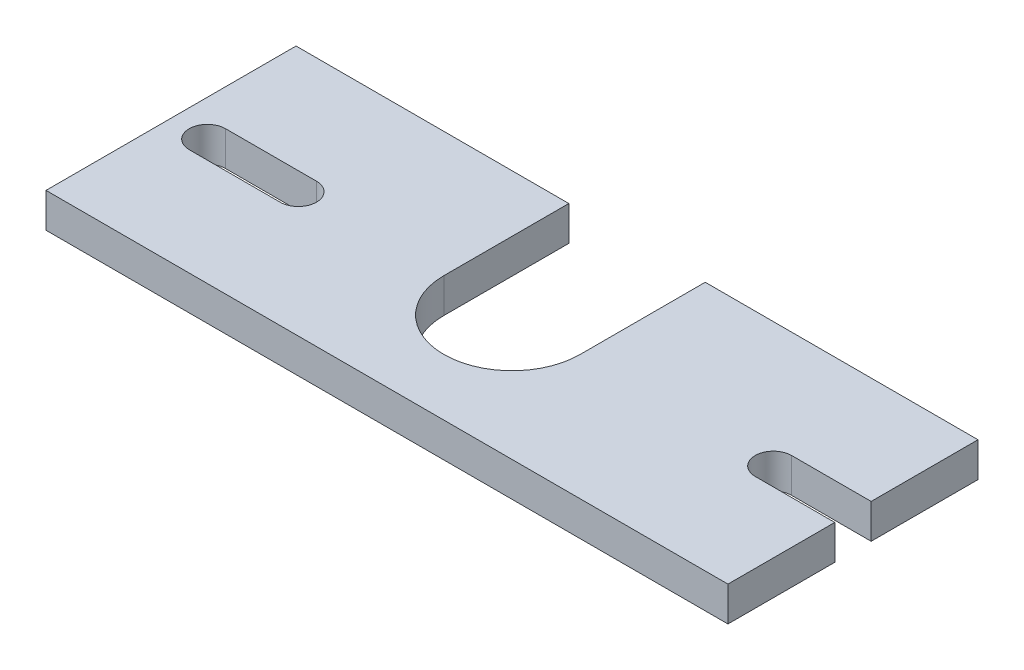
ISO-10303-21;
HEADER;
FILE_DESCRIPTION(('STEP AP214'),'2;1');
FILE_NAME('part.step','',(''),(''),'','','');
FILE_SCHEMA(('AUTOMOTIVE_DESIGN { 1 0 10303 214 1 1 1 1 }'));
ENDSEC;
DATA;
#1=APPLICATION_CONTEXT('core data for automotive mechanical design processes');
#2=APPLICATION_PROTOCOL_DEFINITION('international standard','automotive_design',2000,#1);
#3=PRODUCT_CONTEXT('',#1,'mechanical');
#4=PRODUCT('Part','Part','',(#3));
#5=PRODUCT_RELATED_PRODUCT_CATEGORY('part','',(#4));
#6=PRODUCT_DEFINITION_FORMATION('','',#4);
#7=PRODUCT_DEFINITION_CONTEXT('part definition',#1,'design');
#8=PRODUCT_DEFINITION('design','',#6,#7);
#9=PRODUCT_DEFINITION_SHAPE('','',#8);
#10=(LENGTH_UNIT() NAMED_UNIT(*) SI_UNIT(.MILLI.,.METRE.));
#11=(NAMED_UNIT(*) PLANE_ANGLE_UNIT() SI_UNIT($,.RADIAN.));
#12=(NAMED_UNIT(*) SI_UNIT($,.STERADIAN.) SOLID_ANGLE_UNIT());
#13=UNCERTAINTY_MEASURE_WITH_UNIT(LENGTH_MEASURE(1.E-05),#10,'distance_accuracy_value','');
#14=(GEOMETRIC_REPRESENTATION_CONTEXT(3) GLOBAL_UNCERTAINTY_ASSIGNED_CONTEXT((#13)) GLOBAL_UNIT_ASSIGNED_CONTEXT((#10,
#11,#12)) REPRESENTATION_CONTEXT('',''));
#15=CARTESIAN_POINT('',(0.,0.,0.));
#16=DIRECTION('',(0.,0.,1.));
#17=DIRECTION('',(1.,0.,0.));
#18=AXIS2_PLACEMENT_3D('',#15,#16,#17);
#19=CARTESIAN_POINT('',(30.,3.04,-11.));
#20=DIRECTION('',(0.,1.,0.));
#21=DIRECTION('',(0.,0.,1.));
#22=AXIS2_PLACEMENT_3D('',#19,#20,#21);
#23=PLANE('',#22);
#24=DIRECTION('',(0.,0.,1.));
#25=VECTOR('',#24,1.);
#26=CARTESIAN_POINT('',(0.,3.04,0.));
#27=LINE('',#26,#25);
#28=CARTESIAN_POINT('',(0.,3.04,-22.));
#29=VERTEX_POINT('',#28);
#30=CARTESIAN_POINT('',(0.,3.04,0.));
#31=VERTEX_POINT('',#30);
#32=EDGE_CURVE('E182',#29,#31,#27,.T.);
#33=ORIENTED_EDGE('',*,*,#32,.T.);
#34=DIRECTION('',(1.,0.,0.));
#35=VECTOR('',#34,1.);
#36=CARTESIAN_POINT('',(0.,3.04,0.));
#37=LINE('',#36,#35);
#38=CARTESIAN_POINT('',(60.,3.04,0.));
#39=VERTEX_POINT('',#38);
#40=EDGE_CURVE('E185',#31,#39,#37,.T.);
#41=ORIENTED_EDGE('',*,*,#40,.T.);
#42=DIRECTION('',(0.,0.,-1.));
#43=VECTOR('',#42,1.);
#44=CARTESIAN_POINT('',(60.,3.04,0.));
#45=LINE('',#44,#43);
#46=CARTESIAN_POINT('',(60.,3.04,-9.4));
#47=VERTEX_POINT('',#46);
#48=EDGE_CURVE('E188',#39,#47,#45,.T.);
#49=ORIENTED_EDGE('',*,*,#48,.T.);
#50=DIRECTION('',(-1.,0.,0.));
#51=VECTOR('',#50,1.);
#52=CARTESIAN_POINT('',(53.,3.04,-9.4));
#53=LINE('',#52,#51);
#54=CARTESIAN_POINT('',(53.,3.04,-9.4));
#55=VERTEX_POINT('',#54);
#56=EDGE_CURVE('E190',#47,#55,#53,.T.);
#57=ORIENTED_EDGE('',*,*,#56,.T.);
#58=CARTESIAN_POINT('',(53.,3.04,-11.));
#59=DIRECTION('',(0.,-1.,0.));
#60=DIRECTION('',(0.,0.,1.));
#61=AXIS2_PLACEMENT_3D('',#58,#59,#60);
#62=CIRCLE('',#61,1.6);
#63=CARTESIAN_POINT('',(53.,3.04,-12.6));
#64=VERTEX_POINT('',#63);
#65=EDGE_CURVE('E192',#55,#64,#62,.T.);
#66=ORIENTED_EDGE('',*,*,#65,.T.);
#67=DIRECTION('',(1.,0.,0.));
#68=VECTOR('',#67,1.);
#69=CARTESIAN_POINT('',(53.,3.04,-12.6));
#70=LINE('',#69,#68);
#71=CARTESIAN_POINT('',(60.,3.04,-12.6));
#72=VERTEX_POINT('',#71);
#73=EDGE_CURVE('E194',#64,#72,#70,.T.);
#74=ORIENTED_EDGE('',*,*,#73,.T.);
#75=DIRECTION('',(0.,0.,-1.));
#76=VECTOR('',#75,1.);
#77=CARTESIAN_POINT('',(60.,3.04,-12.6));
#78=LINE('',#77,#76);
#79=CARTESIAN_POINT('',(60.,3.04,-22.));
#80=VERTEX_POINT('',#79);
#81=EDGE_CURVE('E196',#72,#80,#78,.T.);
#82=ORIENTED_EDGE('',*,*,#81,.T.);
#83=DIRECTION('',(-1.,0.,0.));
#84=VECTOR('',#83,1.);
#85=CARTESIAN_POINT('',(36.,3.04,-22.));
#86=LINE('',#85,#84);
#87=CARTESIAN_POINT('',(36.,3.04,-22.));
#88=VERTEX_POINT('',#87);
#89=EDGE_CURVE('E198',#80,#88,#86,.T.);
#90=ORIENTED_EDGE('',*,*,#89,.T.);
#91=DIRECTION('',(0.,0.,1.));
#92=VECTOR('',#91,1.);
#93=CARTESIAN_POINT('',(36.,3.04,-11.));
#94=LINE('',#93,#92);
#95=CARTESIAN_POINT('',(36.,3.04,-11.));
#96=VERTEX_POINT('',#95);
#97=EDGE_CURVE('E200',#88,#96,#94,.T.);
#98=ORIENTED_EDGE('',*,*,#97,.T.);
#99=CARTESIAN_POINT('',(30.,3.04,-11.));
#100=DIRECTION('',(0.,-1.,0.));
#101=DIRECTION('',(0.,0.,1.));
#102=AXIS2_PLACEMENT_3D('',#99,#100,#101);
#103=CIRCLE('',#102,6.);
#104=CARTESIAN_POINT('',(24.,3.04,-11.));
#105=VERTEX_POINT('',#104);
#106=EDGE_CURVE('E202',#96,#105,#103,.T.);
#107=ORIENTED_EDGE('',*,*,#106,.T.);
#108=DIRECTION('',(0.,0.,-1.));
#109=VECTOR('',#108,1.);
#110=CARTESIAN_POINT('',(24.,3.04,-22.));
#111=LINE('',#110,#109);
#112=CARTESIAN_POINT('',(24.,3.04,-22.));
#113=VERTEX_POINT('',#112);
#114=EDGE_CURVE('E204',#105,#113,#111,.T.);
#115=ORIENTED_EDGE('',*,*,#114,.T.);
#116=DIRECTION('',(-1.,0.,0.));
#117=VECTOR('',#116,1.);
#118=CARTESIAN_POINT('',(0.,3.04,-22.));
#119=LINE('',#118,#117);
#120=EDGE_CURVE('E206',#113,#29,#119,.T.);
#121=ORIENTED_EDGE('',*,*,#120,.T.);
#122=EDGE_LOOP('',(#33,#41,#49,#57,#66,#74,#82,#90,#98,#107,#115,#121));
#123=FACE_BOUND('',#122,.T.);
#124=DIRECTION('',(1.,0.,0.));
#125=VECTOR('',#124,1.);
#126=CARTESIAN_POINT('',(3.2,3.04,-9.4));
#127=LINE('',#126,#125);
#128=CARTESIAN_POINT('',(3.2,3.04,-9.4));
#129=VERTEX_POINT('',#128);
#130=CARTESIAN_POINT('',(11.2,3.04,-9.4));
#131=VERTEX_POINT('',#130);
#132=EDGE_CURVE('E154',#129,#131,#127,.T.);
#133=ORIENTED_EDGE('',*,*,#132,.F.);
#134=CARTESIAN_POINT('',(3.2,3.04,-11.));
#135=DIRECTION('',(0.,1.,0.));
#136=DIRECTION('',(0.,0.,1.));
#137=AXIS2_PLACEMENT_3D('',#134,#135,#136);
#138=CIRCLE('',#137,1.6);
#139=CARTESIAN_POINT('',(3.2,3.04,-12.6));
#140=VERTEX_POINT('',#139);
#141=EDGE_CURVE('E146',#140,#129,#138,.T.);
#142=ORIENTED_EDGE('',*,*,#141,.F.);
#143=DIRECTION('',(-1.,0.,0.));
#144=VECTOR('',#143,1.);
#145=CARTESIAN_POINT('',(3.2,3.04,-12.6));
#146=LINE('',#145,#144);
#147=CARTESIAN_POINT('',(11.2,3.04,-12.6));
#148=VERTEX_POINT('',#147);
#149=EDGE_CURVE('E168',#148,#140,#146,.T.);
#150=ORIENTED_EDGE('',*,*,#149,.F.);
#151=CARTESIAN_POINT('',(11.2,3.04,-11.));
#152=DIRECTION('',(0.,1.,0.));
#153=DIRECTION('',(0.,0.,1.));
#154=AXIS2_PLACEMENT_3D('',#151,#152,#153);
#155=CIRCLE('',#154,1.6);
#156=EDGE_CURVE('E166',#131,#148,#155,.T.);
#157=ORIENTED_EDGE('',*,*,#156,.F.);
#158=EDGE_LOOP('',(#133,#142,#150,#157));
#159=FACE_BOUND('',#158,.T.);
#160=ADVANCED_FACE('F33',(#123,#159),#23,.T.);
#161=CARTESIAN_POINT('',(30.,0.,-11.));
#162=DIRECTION('',(0.,1.,0.));
#163=DIRECTION('',(0.,0.,1.));
#164=AXIS2_PLACEMENT_3D('',#161,#162,#163);
#165=PLANE('',#164);
#166=DIRECTION('',(0.,0.,1.));
#167=VECTOR('',#166,1.);
#168=CARTESIAN_POINT('',(0.,0.,0.));
#169=LINE('',#168,#167);
#170=CARTESIAN_POINT('',(0.,0.,-22.));
#171=VERTEX_POINT('',#170);
#172=CARTESIAN_POINT('',(0.,0.,0.));
#173=VERTEX_POINT('',#172);
#174=EDGE_CURVE('E162',#171,#173,#169,.T.);
#175=ORIENTED_EDGE('',*,*,#174,.F.);
#176=DIRECTION('',(-1.,0.,0.));
#177=VECTOR('',#176,1.);
#178=CARTESIAN_POINT('',(0.,0.,-22.));
#179=LINE('',#178,#177);
#180=CARTESIAN_POINT('',(24.,0.,-22.));
#181=VERTEX_POINT('',#180);
#182=EDGE_CURVE('E186',#181,#171,#179,.T.);
#183=ORIENTED_EDGE('',*,*,#182,.F.);
#184=DIRECTION('',(0.,0.,-1.));
#185=VECTOR('',#184,1.);
#186=CARTESIAN_POINT('',(24.,0.,-22.));
#187=LINE('',#186,#185);
#188=CARTESIAN_POINT('',(24.,0.,-11.));
#189=VERTEX_POINT('',#188);
#190=EDGE_CURVE('E229',#189,#181,#187,.T.);
#191=ORIENTED_EDGE('',*,*,#190,.F.);
#192=CARTESIAN_POINT('',(30.,0.,-11.));
#193=DIRECTION('',(0.,-1.,0.));
#194=DIRECTION('',(0.,0.,1.));
#195=AXIS2_PLACEMENT_3D('',#192,#193,#194);
#196=CIRCLE('',#195,6.);
#197=CARTESIAN_POINT('',(36.,0.,-11.));
#198=VERTEX_POINT('',#197);
#199=EDGE_CURVE('E227',#198,#189,#196,.T.);
#200=ORIENTED_EDGE('',*,*,#199,.F.);
#201=DIRECTION('',(0.,0.,1.));
#202=VECTOR('',#201,1.);
#203=CARTESIAN_POINT('',(36.,0.,-11.));
#204=LINE('',#203,#202);
#205=CARTESIAN_POINT('',(36.,0.,-22.));
#206=VERTEX_POINT('',#205);
#207=EDGE_CURVE('E225',#206,#198,#204,.T.);
#208=ORIENTED_EDGE('',*,*,#207,.F.);
#209=DIRECTION('',(-1.,0.,0.));
#210=VECTOR('',#209,1.);
#211=CARTESIAN_POINT('',(36.,0.,-22.));
#212=LINE('',#211,#210);
#213=CARTESIAN_POINT('',(60.,0.,-22.));
#214=VERTEX_POINT('',#213);
#215=EDGE_CURVE('E223',#214,#206,#212,.T.);
#216=ORIENTED_EDGE('',*,*,#215,.F.);
#217=DIRECTION('',(0.,0.,-1.));
#218=VECTOR('',#217,1.);
#219=CARTESIAN_POINT('',(60.,0.,-12.6));
#220=LINE('',#219,#218);
#221=CARTESIAN_POINT('',(60.,0.,-12.6));
#222=VERTEX_POINT('',#221);
#223=EDGE_CURVE('E221',#222,#214,#220,.T.);
#224=ORIENTED_EDGE('',*,*,#223,.F.);
#225=DIRECTION('',(1.,0.,0.));
#226=VECTOR('',#225,1.);
#227=CARTESIAN_POINT('',(53.,0.,-12.6));
#228=LINE('',#227,#226);
#229=CARTESIAN_POINT('',(53.,0.,-12.6));
#230=VERTEX_POINT('',#229);
#231=EDGE_CURVE('E219',#230,#222,#228,.T.);
#232=ORIENTED_EDGE('',*,*,#231,.F.);
#233=CARTESIAN_POINT('',(53.,0.,-11.));
#234=DIRECTION('',(0.,-1.,0.));
#235=DIRECTION('',(0.,0.,1.));
#236=AXIS2_PLACEMENT_3D('',#233,#234,#235);
#237=CIRCLE('',#236,1.6);
#238=CARTESIAN_POINT('',(53.,0.,-9.4));
#239=VERTEX_POINT('',#238);
#240=EDGE_CURVE('E217',#239,#230,#237,.T.);
#241=ORIENTED_EDGE('',*,*,#240,.F.);
#242=DIRECTION('',(-1.,0.,0.));
#243=VECTOR('',#242,1.);
#244=CARTESIAN_POINT('',(53.,0.,-9.4));
#245=LINE('',#244,#243);
#246=CARTESIAN_POINT('',(60.,0.,-9.4));
#247=VERTEX_POINT('',#246);
#248=EDGE_CURVE('E215',#247,#239,#245,.T.);
#249=ORIENTED_EDGE('',*,*,#248,.F.);
#250=DIRECTION('',(0.,0.,-1.));
#251=VECTOR('',#250,1.);
#252=CARTESIAN_POINT('',(60.,0.,0.));
#253=LINE('',#252,#251);
#254=CARTESIAN_POINT('',(60.,0.,0.));
#255=VERTEX_POINT('',#254);
#256=EDGE_CURVE('E213',#255,#247,#253,.T.);
#257=ORIENTED_EDGE('',*,*,#256,.F.);
#258=DIRECTION('',(1.,0.,0.));
#259=VECTOR('',#258,1.);
#260=CARTESIAN_POINT('',(0.,0.,0.));
#261=LINE('',#260,#259);
#262=EDGE_CURVE('E211',#173,#255,#261,.T.);
#263=ORIENTED_EDGE('',*,*,#262,.F.);
#264=EDGE_LOOP('',(#175,#183,#191,#200,#208,#216,#224,#232,#241,#249,#257,#263));
#265=FACE_BOUND('',#264,.T.);
#266=CARTESIAN_POINT('',(3.2,0.,-11.));
#267=DIRECTION('',(0.,1.,0.));
#268=DIRECTION('',(0.,0.,1.));
#269=AXIS2_PLACEMENT_3D('',#266,#267,#268);
#270=CIRCLE('',#269,1.6);
#271=CARTESIAN_POINT('',(3.2,0.,-12.6));
#272=VERTEX_POINT('',#271);
#273=CARTESIAN_POINT('',(3.2,0.,-9.4));
#274=VERTEX_POINT('',#273);
#275=EDGE_CURVE('E56',#272,#274,#270,.T.);
#276=ORIENTED_EDGE('',*,*,#275,.T.);
#277=DIRECTION('',(1.,0.,0.));
#278=VECTOR('',#277,1.);
#279=CARTESIAN_POINT('',(3.2,0.,-9.4));
#280=LINE('',#279,#278);
#281=CARTESIAN_POINT('',(11.2,0.,-9.4));
#282=VERTEX_POINT('',#281);
#283=EDGE_CURVE('E161',#274,#282,#280,.T.);
#284=ORIENTED_EDGE('',*,*,#283,.T.);
#285=CARTESIAN_POINT('',(11.2,0.,-11.));
#286=DIRECTION('',(0.,1.,0.));
#287=DIRECTION('',(0.,0.,1.));
#288=AXIS2_PLACEMENT_3D('',#285,#286,#287);
#289=CIRCLE('',#288,1.6);
#290=CARTESIAN_POINT('',(11.2,0.,-12.6));
#291=VERTEX_POINT('',#290);
#292=EDGE_CURVE('E174',#282,#291,#289,.T.);
#293=ORIENTED_EDGE('',*,*,#292,.T.);
#294=DIRECTION('',(-1.,0.,0.));
#295=VECTOR('',#294,1.);
#296=CARTESIAN_POINT('',(3.2,0.,-12.6));
#297=LINE('',#296,#295);
#298=EDGE_CURVE('E155',#291,#272,#297,.T.);
#299=ORIENTED_EDGE('',*,*,#298,.T.);
#300=EDGE_LOOP('',(#276,#284,#293,#299));
#301=FACE_BOUND('',#300,.T.);
#302=ADVANCED_FACE('F271',(#265,#301),#165,.F.);
#303=CARTESIAN_POINT('',(0.,3.04,0.));
#304=DIRECTION('',(1.,0.,0.));
#305=DIRECTION('',(0.,0.,-1.));
#306=AXIS2_PLACEMENT_3D('',#303,#304,#305);
#307=PLANE('',#306);
#308=ORIENTED_EDGE('',*,*,#174,.T.);
#309=DIRECTION('',(0.,-1.,0.));
#310=VECTOR('',#309,1.);
#311=CARTESIAN_POINT('',(0.,3.04,0.));
#312=LINE('',#311,#310);
#313=EDGE_CURVE('E11',#31,#173,#312,.T.);
#314=ORIENTED_EDGE('',*,*,#313,.F.);
#315=ORIENTED_EDGE('',*,*,#32,.F.);
#316=DIRECTION('',(0.,-1.,0.));
#317=VECTOR('',#316,1.);
#318=CARTESIAN_POINT('',(0.,3.04,-22.));
#319=LINE('',#318,#317);
#320=EDGE_CURVE('E208',#29,#171,#319,.T.);
#321=ORIENTED_EDGE('',*,*,#320,.T.);
#322=EDGE_LOOP('',(#308,#314,#315,#321));
#323=FACE_BOUND('',#322,.T.);
#324=ADVANCED_FACE('F35',(#323),#307,.F.);
#325=CARTESIAN_POINT('',(0.,3.04,0.));
#326=DIRECTION('',(0.,0.,-1.));
#327=DIRECTION('',(-1.,0.,0.));
#328=AXIS2_PLACEMENT_3D('',#325,#326,#327);
#329=PLANE('',#328);
#330=ORIENTED_EDGE('',*,*,#262,.T.);
#331=DIRECTION('',(0.,-1.,0.));
#332=VECTOR('',#331,1.);
#333=CARTESIAN_POINT('',(60.,3.04,0.));
#334=LINE('',#333,#332);
#335=EDGE_CURVE('E41',#39,#255,#334,.T.);
#336=ORIENTED_EDGE('',*,*,#335,.F.);
#337=ORIENTED_EDGE('',*,*,#40,.F.);
#338=ORIENTED_EDGE('',*,*,#313,.T.);
#339=EDGE_LOOP('',(#330,#336,#337,#338));
#340=FACE_BOUND('',#339,.T.);
#341=ADVANCED_FACE('F288',(#340),#329,.F.);
#342=CARTESIAN_POINT('',(60.,3.04,0.));
#343=DIRECTION('',(-1.,0.,0.));
#344=DIRECTION('',(0.,0.,1.));
#345=AXIS2_PLACEMENT_3D('',#342,#343,#344);
#346=PLANE('',#345);
#347=ORIENTED_EDGE('',*,*,#256,.T.);
#348=DIRECTION('',(0.,-1.,0.));
#349=VECTOR('',#348,1.);
#350=CARTESIAN_POINT('',(60.,3.04,-9.4));
#351=LINE('',#350,#349);
#352=EDGE_CURVE('E258',#47,#247,#351,.T.);
#353=ORIENTED_EDGE('',*,*,#352,.F.);
#354=ORIENTED_EDGE('',*,*,#48,.F.);
#355=ORIENTED_EDGE('',*,*,#335,.T.);
#356=EDGE_LOOP('',(#347,#353,#354,#355));
#357=FACE_BOUND('',#356,.T.);
#358=ADVANCED_FACE('F265',(#357),#346,.F.);
#359=CARTESIAN_POINT('',(53.,3.04,-9.4));
#360=DIRECTION('',(0.,0.,1.));
#361=DIRECTION('',(1.,0.,0.));
#362=AXIS2_PLACEMENT_3D('',#359,#360,#361);
#363=PLANE('',#362);
#364=ORIENTED_EDGE('',*,*,#248,.T.);
#365=DIRECTION('',(0.,-1.,0.));
#366=VECTOR('',#365,1.);
#367=CARTESIAN_POINT('',(53.,3.04,-9.4));
#368=LINE('',#367,#366);
#369=EDGE_CURVE('E255',#55,#239,#368,.T.);
#370=ORIENTED_EDGE('',*,*,#369,.F.);
#371=ORIENTED_EDGE('',*,*,#56,.F.);
#372=ORIENTED_EDGE('',*,*,#352,.T.);
#373=EDGE_LOOP('',(#364,#370,#371,#372));
#374=FACE_BOUND('',#373,.T.);
#375=ADVANCED_FACE('F277',(#374),#363,.F.);
#376=CARTESIAN_POINT('',(53.,3.04,-11.));
#377=DIRECTION('',(0.,-1.,0.));
#378=DIRECTION('',(0.,0.,-1.));
#379=AXIS2_PLACEMENT_3D('',#376,#377,#378);
#380=CYLINDRICAL_SURFACE('',#379,1.6);
#381=ORIENTED_EDGE('',*,*,#240,.T.);
#382=DIRECTION('',(0.,-1.,0.));
#383=VECTOR('',#382,1.);
#384=CARTESIAN_POINT('',(53.,3.04,-12.6));
#385=LINE('',#384,#383);
#386=EDGE_CURVE('E252',#64,#230,#385,.T.);
#387=ORIENTED_EDGE('',*,*,#386,.F.);
#388=ORIENTED_EDGE('',*,*,#65,.F.);
#389=ORIENTED_EDGE('',*,*,#369,.T.);
#390=EDGE_LOOP('',(#381,#387,#388,#389));
#391=FACE_BOUND('',#390,.T.);
#392=ADVANCED_FACE('F281',(#391),#380,.F.);
#393=CARTESIAN_POINT('',(53.,3.04,-12.6));
#394=DIRECTION('',(0.,0.,-1.));
#395=DIRECTION('',(-1.,0.,0.));
#396=AXIS2_PLACEMENT_3D('',#393,#394,#395);
#397=PLANE('',#396);
#398=ORIENTED_EDGE('',*,*,#231,.T.);
#399=DIRECTION('',(0.,-1.,0.));
#400=VECTOR('',#399,1.);
#401=CARTESIAN_POINT('',(60.,3.04,-12.6));
#402=LINE('',#401,#400);
#403=EDGE_CURVE('E249',#72,#222,#402,.T.);
#404=ORIENTED_EDGE('',*,*,#403,.F.);
#405=ORIENTED_EDGE('',*,*,#73,.F.);
#406=ORIENTED_EDGE('',*,*,#386,.T.);
#407=EDGE_LOOP('',(#398,#404,#405,#406));
#408=FACE_BOUND('',#407,.T.);
#409=ADVANCED_FACE('F321',(#408),#397,.F.);
#410=CARTESIAN_POINT('',(60.,3.04,-12.6));
#411=DIRECTION('',(-1.,0.,0.));
#412=DIRECTION('',(0.,0.,1.));
#413=AXIS2_PLACEMENT_3D('',#410,#411,#412);
#414=PLANE('',#413);
#415=ORIENTED_EDGE('',*,*,#223,.T.);
#416=DIRECTION('',(0.,-1.,0.));
#417=VECTOR('',#416,1.);
#418=CARTESIAN_POINT('',(60.,3.04,-22.));
#419=LINE('',#418,#417);
#420=EDGE_CURVE('E246',#80,#214,#419,.T.);
#421=ORIENTED_EDGE('',*,*,#420,.F.);
#422=ORIENTED_EDGE('',*,*,#81,.F.);
#423=ORIENTED_EDGE('',*,*,#403,.T.);
#424=EDGE_LOOP('',(#415,#421,#422,#423));
#425=FACE_BOUND('',#424,.T.);
#426=ADVANCED_FACE('F319',(#425),#414,.F.);
#427=CARTESIAN_POINT('',(36.,3.04,-22.));
#428=DIRECTION('',(0.,0.,1.));
#429=DIRECTION('',(1.,0.,0.));
#430=AXIS2_PLACEMENT_3D('',#427,#428,#429);
#431=PLANE('',#430);
#432=ORIENTED_EDGE('',*,*,#215,.T.);
#433=DIRECTION('',(0.,-1.,0.));
#434=VECTOR('',#433,1.);
#435=CARTESIAN_POINT('',(36.,3.04,-22.));
#436=LINE('',#435,#434);
#437=EDGE_CURVE('E243',#88,#206,#436,.T.);
#438=ORIENTED_EDGE('',*,*,#437,.F.);
#439=ORIENTED_EDGE('',*,*,#89,.F.);
#440=ORIENTED_EDGE('',*,*,#420,.T.);
#441=EDGE_LOOP('',(#432,#438,#439,#440));
#442=FACE_BOUND('',#441,.T.);
#443=ADVANCED_FACE('F315',(#442),#431,.F.);
#444=CARTESIAN_POINT('',(36.,3.04,-11.));
#445=DIRECTION('',(1.,0.,0.));
#446=DIRECTION('',(0.,0.,-1.));
#447=AXIS2_PLACEMENT_3D('',#444,#445,#446);
#448=PLANE('',#447);
#449=ORIENTED_EDGE('',*,*,#207,.T.);
#450=DIRECTION('',(0.,-1.,0.));
#451=VECTOR('',#450,1.);
#452=CARTESIAN_POINT('',(36.,3.04,-11.));
#453=LINE('',#452,#451);
#454=EDGE_CURVE('E240',#96,#198,#453,.T.);
#455=ORIENTED_EDGE('',*,*,#454,.F.);
#456=ORIENTED_EDGE('',*,*,#97,.F.);
#457=ORIENTED_EDGE('',*,*,#437,.T.);
#458=EDGE_LOOP('',(#449,#455,#456,#457));
#459=FACE_BOUND('',#458,.T.);
#460=ADVANCED_FACE('F310',(#459),#448,.F.);
#461=CARTESIAN_POINT('',(30.,3.04,-11.));
#462=DIRECTION('',(0.,-1.,0.));
#463=DIRECTION('',(0.,0.,-1.));
#464=AXIS2_PLACEMENT_3D('',#461,#462,#463);
#465=CYLINDRICAL_SURFACE('',#464,6.);
#466=ORIENTED_EDGE('',*,*,#199,.T.);
#467=DIRECTION('',(0.,-1.,0.));
#468=VECTOR('',#467,1.);
#469=CARTESIAN_POINT('',(24.,3.04,-11.));
#470=LINE('',#469,#468);
#471=EDGE_CURVE('E237',#105,#189,#470,.T.);
#472=ORIENTED_EDGE('',*,*,#471,.F.);
#473=ORIENTED_EDGE('',*,*,#106,.F.);
#474=ORIENTED_EDGE('',*,*,#454,.T.);
#475=EDGE_LOOP('',(#466,#472,#473,#474));
#476=FACE_BOUND('',#475,.T.);
#477=ADVANCED_FACE('F304',(#476),#465,.F.);
#478=CARTESIAN_POINT('',(24.,3.04,-22.));
#479=DIRECTION('',(-1.,0.,0.));
#480=DIRECTION('',(0.,0.,1.));
#481=AXIS2_PLACEMENT_3D('',#478,#479,#480);
#482=PLANE('',#481);
#483=ORIENTED_EDGE('',*,*,#190,.T.);
#484=DIRECTION('',(0.,-1.,0.));
#485=VECTOR('',#484,1.);
#486=CARTESIAN_POINT('',(24.,3.04,-22.));
#487=LINE('',#486,#485);
#488=EDGE_CURVE('E234',#113,#181,#487,.T.);
#489=ORIENTED_EDGE('',*,*,#488,.F.);
#490=ORIENTED_EDGE('',*,*,#114,.F.);
#491=ORIENTED_EDGE('',*,*,#471,.T.);
#492=EDGE_LOOP('',(#483,#489,#490,#491));
#493=FACE_BOUND('',#492,.T.);
#494=ADVANCED_FACE('F300',(#493),#482,.F.);
#495=CARTESIAN_POINT('',(0.,3.04,-22.));
#496=DIRECTION('',(0.,0.,1.));
#497=DIRECTION('',(1.,0.,0.));
#498=AXIS2_PLACEMENT_3D('',#495,#496,#497);
#499=PLANE('',#498);
#500=ORIENTED_EDGE('',*,*,#182,.T.);
#501=ORIENTED_EDGE('',*,*,#320,.F.);
#502=ORIENTED_EDGE('',*,*,#120,.F.);
#503=ORIENTED_EDGE('',*,*,#488,.T.);
#504=EDGE_LOOP('',(#500,#501,#502,#503));
#505=FACE_BOUND('',#504,.T.);
#506=ADVANCED_FACE('F295',(#505),#499,.F.);
#507=CARTESIAN_POINT('',(3.2,3.04,-11.));
#508=DIRECTION('',(0.,-1.,0.));
#509=DIRECTION('',(0.,0.,-1.));
#510=AXIS2_PLACEMENT_3D('',#507,#508,#509);
#511=CYLINDRICAL_SURFACE('',#510,1.6);
#512=ORIENTED_EDGE('',*,*,#275,.F.);
#513=DIRECTION('',(0.,-1.,0.));
#514=VECTOR('',#513,1.);
#515=CARTESIAN_POINT('',(3.2,3.04,-12.6));
#516=LINE('',#515,#514);
#517=EDGE_CURVE('E150',#140,#272,#516,.T.);
#518=ORIENTED_EDGE('',*,*,#517,.F.);
#519=ORIENTED_EDGE('',*,*,#141,.T.);
#520=DIRECTION('',(0.,-1.,0.));
#521=VECTOR('',#520,1.);
#522=CARTESIAN_POINT('',(3.2,3.04,-9.4));
#523=LINE('',#522,#521);
#524=EDGE_CURVE('E149',#129,#274,#523,.T.);
#525=ORIENTED_EDGE('',*,*,#524,.T.);
#526=EDGE_LOOP('',(#512,#518,#519,#525));
#527=FACE_BOUND('',#526,.T.);
#528=ADVANCED_FACE('F148',(#527),#511,.F.);
#529=CARTESIAN_POINT('',(3.2,3.04,-9.4));
#530=DIRECTION('',(0.,0.,-1.));
#531=DIRECTION('',(-1.,0.,0.));
#532=AXIS2_PLACEMENT_3D('',#529,#530,#531);
#533=PLANE('',#532);
#534=ORIENTED_EDGE('',*,*,#283,.F.);
#535=ORIENTED_EDGE('',*,*,#524,.F.);
#536=ORIENTED_EDGE('',*,*,#132,.T.);
#537=DIRECTION('',(0.,-1.,0.));
#538=VECTOR('',#537,1.);
#539=CARTESIAN_POINT('',(11.2,3.04,-9.4));
#540=LINE('',#539,#538);
#541=EDGE_CURVE('E163',#131,#282,#540,.T.);
#542=ORIENTED_EDGE('',*,*,#541,.T.);
#543=EDGE_LOOP('',(#534,#535,#536,#542));
#544=FACE_BOUND('',#543,.T.);
#545=ADVANCED_FACE('F158',(#544),#533,.T.);
#546=CARTESIAN_POINT('',(11.2,3.04,-11.));
#547=DIRECTION('',(0.,-1.,0.));
#548=DIRECTION('',(0.,0.,-1.));
#549=AXIS2_PLACEMENT_3D('',#546,#547,#548);
#550=CYLINDRICAL_SURFACE('',#549,1.6);
#551=ORIENTED_EDGE('',*,*,#292,.F.);
#552=ORIENTED_EDGE('',*,*,#541,.F.);
#553=ORIENTED_EDGE('',*,*,#156,.T.);
#554=DIRECTION('',(0.,-1.,0.));
#555=VECTOR('',#554,1.);
#556=CARTESIAN_POINT('',(11.2,3.04,-12.6));
#557=LINE('',#556,#555);
#558=EDGE_CURVE('E48',#148,#291,#557,.T.);
#559=ORIENTED_EDGE('',*,*,#558,.T.);
#560=EDGE_LOOP('',(#551,#552,#553,#559));
#561=FACE_BOUND('',#560,.T.);
#562=ADVANCED_FACE('F379',(#561),#550,.F.);
#563=CARTESIAN_POINT('',(3.2,3.04,-12.6));
#564=DIRECTION('',(0.,0.,1.));
#565=DIRECTION('',(1.,0.,0.));
#566=AXIS2_PLACEMENT_3D('',#563,#564,#565);
#567=PLANE('',#566);
#568=ORIENTED_EDGE('',*,*,#298,.F.);
#569=ORIENTED_EDGE('',*,*,#558,.F.);
#570=ORIENTED_EDGE('',*,*,#149,.T.);
#571=ORIENTED_EDGE('',*,*,#517,.T.);
#572=EDGE_LOOP('',(#568,#569,#570,#571));
#573=FACE_BOUND('',#572,.T.);
#574=ADVANCED_FACE('F385',(#573),#567,.T.);
#575=CLOSED_SHELL('',(#160,#302,#324,#341,#358,#375,#392,#409,#426,#443,#460,#477,#494,#506,
#528,#545,#562,#574));
#576=MANIFOLD_SOLID_BREP('B2',#575);
#577=ADVANCED_BREP_SHAPE_REPRESENTATION('',(#18,#576),#14);
#578=SHAPE_DEFINITION_REPRESENTATION(#9,#577);
ENDSEC;
END-ISO-10303-21;
